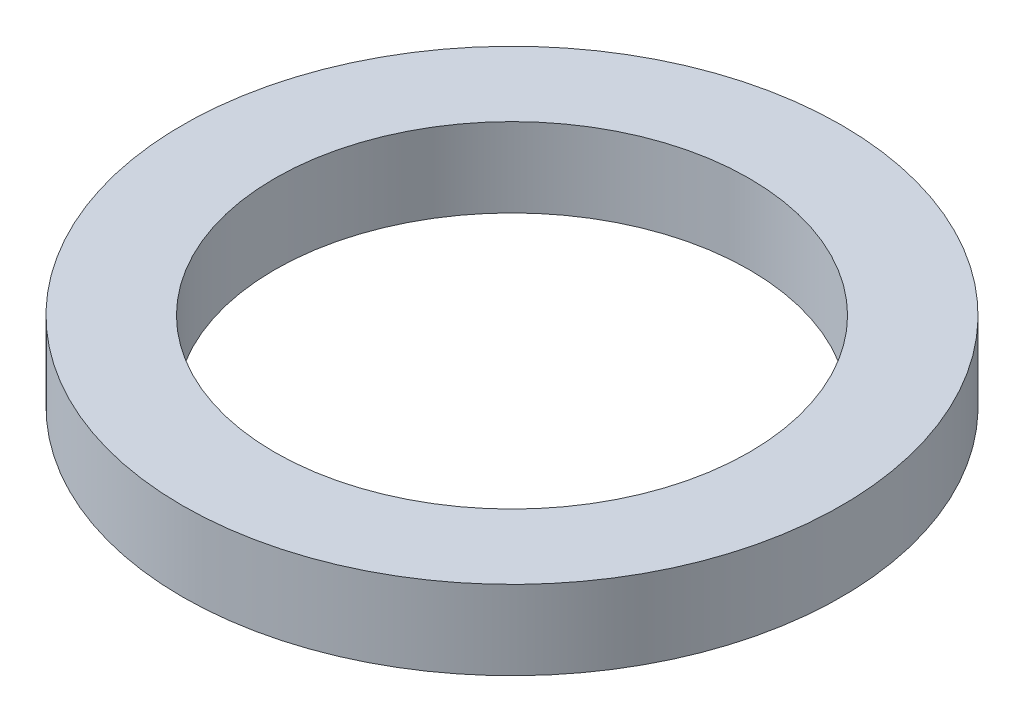
ISO-10303-21;
HEADER;
FILE_DESCRIPTION(('STEP AP214'),'2;1');
FILE_NAME('part.step','',(''),(''),'','','');
FILE_SCHEMA(('AUTOMOTIVE_DESIGN { 1 0 10303 214 1 1 1 1 }'));
ENDSEC;
DATA;
#1=APPLICATION_CONTEXT('core data for automotive mechanical design processes');
#2=APPLICATION_PROTOCOL_DEFINITION('international standard','automotive_design',2000,#1);
#3=PRODUCT_CONTEXT('',#1,'mechanical');
#4=PRODUCT('Part','Part','',(#3));
#5=PRODUCT_RELATED_PRODUCT_CATEGORY('part','',(#4));
#6=PRODUCT_DEFINITION_FORMATION('','',#4);
#7=PRODUCT_DEFINITION_CONTEXT('part definition',#1,'design');
#8=PRODUCT_DEFINITION('design','',#6,#7);
#9=PRODUCT_DEFINITION_SHAPE('','',#8);
#10=(LENGTH_UNIT() NAMED_UNIT(*) SI_UNIT(.MILLI.,.METRE.));
#11=(NAMED_UNIT(*) PLANE_ANGLE_UNIT() SI_UNIT($,.RADIAN.));
#12=(NAMED_UNIT(*) SI_UNIT($,.STERADIAN.) SOLID_ANGLE_UNIT());
#13=UNCERTAINTY_MEASURE_WITH_UNIT(LENGTH_MEASURE(1.E-05),#10,'distance_accuracy_value','');
#14=(GEOMETRIC_REPRESENTATION_CONTEXT(3) GLOBAL_UNCERTAINTY_ASSIGNED_CONTEXT((#13)) GLOBAL_UNIT_ASSIGNED_CONTEXT((#10,
#11,#12)) REPRESENTATION_CONTEXT('',''));
#15=CARTESIAN_POINT('',(0.,0.,0.));
#16=DIRECTION('',(0.,0.,1.));
#17=DIRECTION('',(1.,0.,0.));
#18=AXIS2_PLACEMENT_3D('',#15,#16,#17);
#19=CARTESIAN_POINT('',(0.,1.2,0.));
#20=DIRECTION('',(0.,1.,0.));
#21=DIRECTION('',(0.,0.,1.));
#22=AXIS2_PLACEMENT_3D('',#19,#20,#21);
#23=PLANE('',#22);
#24=CARTESIAN_POINT('',(0.,1.2,0.));
#25=DIRECTION('',(0.,1.,0.));
#26=DIRECTION('',(0.,0.,1.));
#27=AXIS2_PLACEMENT_3D('',#24,#25,#26);
#28=CIRCLE('',#27,5.);
#29=CARTESIAN_POINT('',(0.,1.2,5.));
#30=VERTEX_POINT('',#29);
#31=EDGE_CURVE('E10',#30,#30,#28,.T.);
#32=ORIENTED_EDGE('',*,*,#31,.T.);
#33=EDGE_LOOP('',(#32));
#34=FACE_BOUND('',#33,.T.);
#35=CARTESIAN_POINT('',(0.,1.2,0.));
#36=DIRECTION('',(0.,1.,0.));
#37=DIRECTION('',(0.,0.,1.));
#38=AXIS2_PLACEMENT_3D('',#35,#36,#37);
#39=CIRCLE('',#38,3.6);
#40=CARTESIAN_POINT('',(0.,1.2,3.6));
#41=VERTEX_POINT('',#40);
#42=EDGE_CURVE('E50',#41,#41,#39,.T.);
#43=ORIENTED_EDGE('',*,*,#42,.F.);
#44=EDGE_LOOP('',(#43));
#45=FACE_BOUND('',#44,.T.);
#46=ADVANCED_FACE('F37',(#34,#45),#23,.T.);
#47=CARTESIAN_POINT('',(0.,0.,0.));
#48=DIRECTION('',(0.,1.,0.));
#49=DIRECTION('',(0.,0.,1.));
#50=AXIS2_PLACEMENT_3D('',#47,#48,#49);
#51=PLANE('',#50);
#52=CARTESIAN_POINT('',(0.,0.,0.));
#53=DIRECTION('',(0.,1.,0.));
#54=DIRECTION('',(0.,0.,1.));
#55=AXIS2_PLACEMENT_3D('',#52,#53,#54);
#56=CIRCLE('',#55,5.);
#57=CARTESIAN_POINT('',(0.,0.,5.));
#58=VERTEX_POINT('',#57);
#59=EDGE_CURVE('E41',#58,#58,#56,.T.);
#60=ORIENTED_EDGE('',*,*,#59,.F.);
#61=EDGE_LOOP('',(#60));
#62=FACE_BOUND('',#61,.T.);
#63=CARTESIAN_POINT('',(0.,0.,0.));
#64=DIRECTION('',(0.,1.,0.));
#65=DIRECTION('',(0.,0.,1.));
#66=AXIS2_PLACEMENT_3D('',#63,#64,#65);
#67=CIRCLE('',#66,3.6);
#68=CARTESIAN_POINT('',(0.,0.,3.6));
#69=VERTEX_POINT('',#68);
#70=EDGE_CURVE('E52',#69,#69,#67,.T.);
#71=ORIENTED_EDGE('',*,*,#70,.T.);
#72=EDGE_LOOP('',(#71));
#73=FACE_BOUND('',#72,.T.);
#74=ADVANCED_FACE('F64',(#62,#73),#51,.F.);
#75=CARTESIAN_POINT('',(0.,1.2,0.));
#76=DIRECTION('',(0.,-1.,0.));
#77=DIRECTION('',(0.,0.,-1.));
#78=AXIS2_PLACEMENT_3D('',#75,#76,#77);
#79=CYLINDRICAL_SURFACE('',#78,5.);
#80=ORIENTED_EDGE('',*,*,#31,.F.);
#81=EDGE_LOOP('',(#80));
#82=FACE_BOUND('',#81,.T.);
#83=ORIENTED_EDGE('',*,*,#59,.T.);
#84=EDGE_LOOP('',(#83));
#85=FACE_BOUND('',#84,.T.);
#86=ADVANCED_FACE('F39',(#82,#85),#79,.T.);
#87=CARTESIAN_POINT('',(0.,1.2,0.));
#88=DIRECTION('',(0.,-1.,0.));
#89=DIRECTION('',(0.,0.,-1.));
#90=AXIS2_PLACEMENT_3D('',#87,#88,#89);
#91=CYLINDRICAL_SURFACE('',#90,3.6);
#92=ORIENTED_EDGE('',*,*,#42,.T.);
#93=EDGE_LOOP('',(#92));
#94=FACE_BOUND('',#93,.T.);
#95=ORIENTED_EDGE('',*,*,#70,.F.);
#96=EDGE_LOOP('',(#95));
#97=FACE_BOUND('',#96,.T.);
#98=ADVANCED_FACE('F60',(#94,#97),#91,.F.);
#99=CLOSED_SHELL('',(#46,#74,#86,#98));
#100=MANIFOLD_SOLID_BREP('B2',#99);
#101=ADVANCED_BREP_SHAPE_REPRESENTATION('',(#18,#100),#14);
#102=SHAPE_DEFINITION_REPRESENTATION(#9,#101);
ENDSEC;
END-ISO-10303-21;
